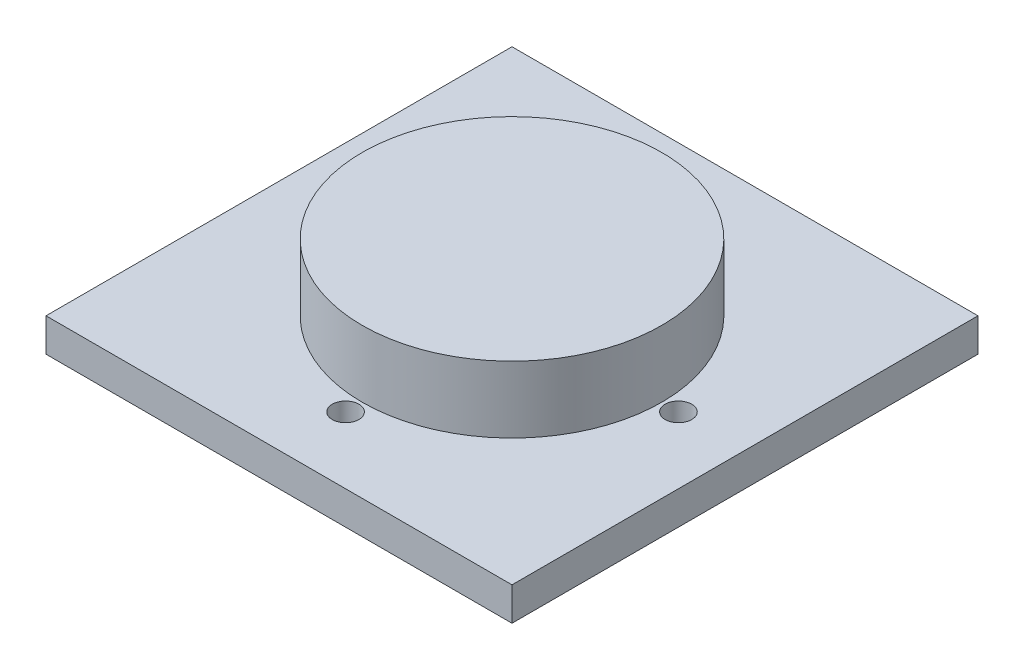
ISO-10303-21;
HEADER;
FILE_DESCRIPTION(('STEP AP214'),'2;1');
FILE_NAME('part.step','',(''),(''),'','','');
FILE_SCHEMA(('AUTOMOTIVE_DESIGN { 1 0 10303 214 1 1 1 1 }'));
ENDSEC;
DATA;
#1=APPLICATION_CONTEXT('core data for automotive mechanical design processes');
#2=APPLICATION_PROTOCOL_DEFINITION('international standard','automotive_design',2000,#1);
#3=PRODUCT_CONTEXT('',#1,'mechanical');
#4=PRODUCT('Part','Part','',(#3));
#5=PRODUCT_RELATED_PRODUCT_CATEGORY('part','',(#4));
#6=PRODUCT_DEFINITION_FORMATION('','',#4);
#7=PRODUCT_DEFINITION_CONTEXT('part definition',#1,'design');
#8=PRODUCT_DEFINITION('design','',#6,#7);
#9=PRODUCT_DEFINITION_SHAPE('','',#8);
#10=(LENGTH_UNIT() NAMED_UNIT(*) SI_UNIT(.MILLI.,.METRE.));
#11=(NAMED_UNIT(*) PLANE_ANGLE_UNIT() SI_UNIT($,.RADIAN.));
#12=(NAMED_UNIT(*) SI_UNIT($,.STERADIAN.) SOLID_ANGLE_UNIT());
#13=UNCERTAINTY_MEASURE_WITH_UNIT(LENGTH_MEASURE(1.E-05),#10,'distance_accuracy_value','');
#14=(GEOMETRIC_REPRESENTATION_CONTEXT(3) GLOBAL_UNCERTAINTY_ASSIGNED_CONTEXT((#13)) GLOBAL_UNIT_ASSIGNED_CONTEXT((#10,
#11,#12)) REPRESENTATION_CONTEXT('',''));
#15=CARTESIAN_POINT('',(0.,0.,0.));
#16=DIRECTION('',(0.,0.,1.));
#17=DIRECTION('',(1.,0.,0.));
#18=AXIS2_PLACEMENT_3D('',#15,#16,#17);
#19=CARTESIAN_POINT('',(0.,0.,0.));
#20=DIRECTION('',(0.,1.,0.));
#21=DIRECTION('',(1.,0.,0.));
#22=AXIS2_PLACEMENT_3D('',#19,#20,#21);
#23=PLANE('',#22);
#24=CARTESIAN_POINT('',(0.,0.,-25.));
#25=DIRECTION('',(0.,-1.,0.));
#26=DIRECTION('',(1.,0.,0.));
#27=AXIS2_PLACEMENT_3D('',#24,#25,#26);
#28=CIRCLE('',#27,2.);
#29=CARTESIAN_POINT('',(-2.,0.,-25.));
#30=VERTEX_POINT('',#29);
#31=EDGE_CURVE('E36',#30,#30,#28,.T.);
#32=ORIENTED_EDGE('',*,*,#31,.F.);
#33=EDGE_LOOP('',(#32));
#34=FACE_BOUND('',#33,.T.);
#35=CARTESIAN_POINT('',(25.,0.,0.));
#36=DIRECTION('',(0.,-1.,0.));
#37=DIRECTION('',(1.,0.,0.));
#38=AXIS2_PLACEMENT_3D('',#35,#36,#37);
#39=CIRCLE('',#38,2.);
#40=CARTESIAN_POINT('',(23.,0.,0.));
#41=VERTEX_POINT('',#40);
#42=EDGE_CURVE('E120',#41,#41,#39,.T.);
#43=ORIENTED_EDGE('',*,*,#42,.F.);
#44=EDGE_LOOP('',(#43));
#45=FACE_BOUND('',#44,.T.);
#46=CARTESIAN_POINT('',(0.,0.,25.));
#47=DIRECTION('',(0.,-1.,0.));
#48=DIRECTION('',(1.,0.,0.));
#49=AXIS2_PLACEMENT_3D('',#46,#47,#48);
#50=CIRCLE('',#49,2.);
#51=CARTESIAN_POINT('',(-2.,0.,25.));
#52=VERTEX_POINT('',#51);
#53=EDGE_CURVE('E134',#52,#52,#50,.T.);
#54=ORIENTED_EDGE('',*,*,#53,.F.);
#55=EDGE_LOOP('',(#54));
#56=FACE_BOUND('',#55,.T.);
#57=CARTESIAN_POINT('',(-25.,0.,0.));
#58=DIRECTION('',(0.,-1.,0.));
#59=DIRECTION('',(1.,0.,0.));
#60=AXIS2_PLACEMENT_3D('',#57,#58,#59);
#61=CIRCLE('',#60,2.);
#62=CARTESIAN_POINT('',(-27.,0.,0.));
#63=VERTEX_POINT('',#62);
#64=EDGE_CURVE('E147',#63,#63,#61,.T.);
#65=ORIENTED_EDGE('',*,*,#64,.F.);
#66=EDGE_LOOP('',(#65));
#67=FACE_BOUND('',#66,.T.);
#68=DIRECTION('',(0.,0.,-1.));
#69=VECTOR('',#68,1.);
#70=CARTESIAN_POINT('',(35.,0.,35.));
#71=LINE('',#70,#69);
#72=CARTESIAN_POINT('',(35.,0.,35.));
#73=VERTEX_POINT('',#72);
#74=CARTESIAN_POINT('',(35.,0.,-35.));
#75=VERTEX_POINT('',#74);
#76=EDGE_CURVE('E42',#73,#75,#71,.T.);
#77=ORIENTED_EDGE('',*,*,#76,.F.);
#78=DIRECTION('',(1.,0.,0.));
#79=VECTOR('',#78,1.);
#80=CARTESIAN_POINT('',(-35.,0.,35.));
#81=LINE('',#80,#79);
#82=CARTESIAN_POINT('',(-35.,0.,35.));
#83=VERTEX_POINT('',#82);
#84=EDGE_CURVE('E117',#83,#73,#81,.T.);
#85=ORIENTED_EDGE('',*,*,#84,.F.);
#86=DIRECTION('',(0.,0.,1.));
#87=VECTOR('',#86,1.);
#88=CARTESIAN_POINT('',(-35.,0.,-35.));
#89=LINE('',#88,#87);
#90=CARTESIAN_POINT('',(-35.,0.,-35.));
#91=VERTEX_POINT('',#90);
#92=EDGE_CURVE('E77',#91,#83,#89,.T.);
#93=ORIENTED_EDGE('',*,*,#92,.F.);
#94=DIRECTION('',(-1.,0.,0.));
#95=VECTOR('',#94,1.);
#96=CARTESIAN_POINT('',(35.,0.,-35.));
#97=LINE('',#96,#95);
#98=EDGE_CURVE('E138',#75,#91,#97,.T.);
#99=ORIENTED_EDGE('',*,*,#98,.F.);
#100=EDGE_LOOP('',(#77,#85,#93,#99));
#101=FACE_BOUND('',#100,.T.);
#102=ADVANCED_FACE('F32',(#34,#45,#56,#67,#101),#23,.F.);
#103=CARTESIAN_POINT('',(0.,5.,0.));
#104=DIRECTION('',(0.,1.,0.));
#105=DIRECTION('',(1.,0.,0.));
#106=AXIS2_PLACEMENT_3D('',#103,#104,#105);
#107=PLANE('',#106);
#108=CARTESIAN_POINT('',(0.,5.,0.));
#109=DIRECTION('',(0.,1.,0.));
#110=DIRECTION('',(0.,0.,1.));
#111=AXIS2_PLACEMENT_3D('',#108,#109,#110);
#112=CIRCLE('',#111,22.5);
#113=CARTESIAN_POINT('',(0.,5.,22.5));
#114=VERTEX_POINT('',#113);
#115=EDGE_CURVE('E161',#114,#114,#112,.T.);
#116=ORIENTED_EDGE('',*,*,#115,.F.);
#117=EDGE_LOOP('',(#116));
#118=FACE_BOUND('',#117,.T.);
#119=CARTESIAN_POINT('',(0.,5.,-25.));
#120=DIRECTION('',(0.,-1.,0.));
#121=DIRECTION('',(1.,0.,0.));
#122=AXIS2_PLACEMENT_3D('',#119,#120,#121);
#123=CIRCLE('',#122,2.);
#124=CARTESIAN_POINT('',(-2.,5.,-25.));
#125=VERTEX_POINT('',#124);
#126=EDGE_CURVE('E133',#125,#125,#123,.T.);
#127=ORIENTED_EDGE('',*,*,#126,.T.);
#128=EDGE_LOOP('',(#127));
#129=FACE_BOUND('',#128,.T.);
#130=CARTESIAN_POINT('',(25.,5.,0.));
#131=DIRECTION('',(0.,-1.,0.));
#132=DIRECTION('',(1.,0.,0.));
#133=AXIS2_PLACEMENT_3D('',#130,#131,#132);
#134=CIRCLE('',#133,2.);
#135=CARTESIAN_POINT('',(23.,5.,0.));
#136=VERTEX_POINT('',#135);
#137=EDGE_CURVE('E128',#136,#136,#134,.T.);
#138=ORIENTED_EDGE('',*,*,#137,.T.);
#139=EDGE_LOOP('',(#138));
#140=FACE_BOUND('',#139,.T.);
#141=CARTESIAN_POINT('',(0.,5.,25.));
#142=DIRECTION('',(0.,-1.,0.));
#143=DIRECTION('',(1.,0.,0.));
#144=AXIS2_PLACEMENT_3D('',#141,#142,#143);
#145=CIRCLE('',#144,2.);
#146=CARTESIAN_POINT('',(-2.,5.,25.));
#147=VERTEX_POINT('',#146);
#148=EDGE_CURVE('E142',#147,#147,#145,.T.);
#149=ORIENTED_EDGE('',*,*,#148,.T.);
#150=EDGE_LOOP('',(#149));
#151=FACE_BOUND('',#150,.T.);
#152=CARTESIAN_POINT('',(-25.,5.,0.));
#153=DIRECTION('',(0.,-1.,0.));
#154=DIRECTION('',(1.,0.,0.));
#155=AXIS2_PLACEMENT_3D('',#152,#153,#154);
#156=CIRCLE('',#155,2.);
#157=CARTESIAN_POINT('',(-27.,5.,0.));
#158=VERTEX_POINT('',#157);
#159=EDGE_CURVE('E136',#158,#158,#156,.T.);
#160=ORIENTED_EDGE('',*,*,#159,.T.);
#161=EDGE_LOOP('',(#160));
#162=FACE_BOUND('',#161,.T.);
#163=DIRECTION('',(0.,0.,-1.));
#164=VECTOR('',#163,1.);
#165=CARTESIAN_POINT('',(35.,5.,35.));
#166=LINE('',#165,#164);
#167=CARTESIAN_POINT('',(35.,5.,35.));
#168=VERTEX_POINT('',#167);
#169=CARTESIAN_POINT('',(35.,5.,-35.));
#170=VERTEX_POINT('',#169);
#171=EDGE_CURVE('E11',#168,#170,#166,.T.);
#172=ORIENTED_EDGE('',*,*,#171,.T.);
#173=DIRECTION('',(-1.,0.,0.));
#174=VECTOR('',#173,1.);
#175=CARTESIAN_POINT('',(35.,5.,-35.));
#176=LINE('',#175,#174);
#177=CARTESIAN_POINT('',(-35.,5.,-35.));
#178=VERTEX_POINT('',#177);
#179=EDGE_CURVE('E105',#170,#178,#176,.T.);
#180=ORIENTED_EDGE('',*,*,#179,.T.);
#181=DIRECTION('',(0.,0.,1.));
#182=VECTOR('',#181,1.);
#183=CARTESIAN_POINT('',(-35.,5.,-35.));
#184=LINE('',#183,#182);
#185=CARTESIAN_POINT('',(-35.,5.,35.));
#186=VERTEX_POINT('',#185);
#187=EDGE_CURVE('E100',#178,#186,#184,.T.);
#188=ORIENTED_EDGE('',*,*,#187,.T.);
#189=DIRECTION('',(1.,0.,0.));
#190=VECTOR('',#189,1.);
#191=CARTESIAN_POINT('',(-35.,5.,35.));
#192=LINE('',#191,#190);
#193=EDGE_CURVE('E102',#186,#168,#192,.T.);
#194=ORIENTED_EDGE('',*,*,#193,.T.);
#195=EDGE_LOOP('',(#172,#180,#188,#194));
#196=FACE_BOUND('',#195,.T.);
#197=ADVANCED_FACE('F34',(#118,#129,#140,#151,#162,#196),#107,.T.);
#198=CARTESIAN_POINT('',(35.,0.,35.));
#199=DIRECTION('',(1.,0.,0.));
#200=DIRECTION('',(0.,1.,0.));
#201=AXIS2_PLACEMENT_3D('',#198,#199,#200);
#202=PLANE('',#201);
#203=ORIENTED_EDGE('',*,*,#76,.T.);
#204=DIRECTION('',(0.,1.,0.));
#205=VECTOR('',#204,1.);
#206=CARTESIAN_POINT('',(35.,0.,-35.));
#207=LINE('',#206,#205);
#208=EDGE_CURVE('E124',#75,#170,#207,.T.);
#209=ORIENTED_EDGE('',*,*,#208,.T.);
#210=ORIENTED_EDGE('',*,*,#171,.F.);
#211=DIRECTION('',(0.,1.,0.));
#212=VECTOR('',#211,1.);
#213=CARTESIAN_POINT('',(35.,0.,35.));
#214=LINE('',#213,#212);
#215=EDGE_CURVE('E115',#73,#168,#214,.T.);
#216=ORIENTED_EDGE('',*,*,#215,.F.);
#217=EDGE_LOOP('',(#203,#209,#210,#216));
#218=FACE_BOUND('',#217,.T.);
#219=ADVANCED_FACE('F178',(#218),#202,.T.);
#220=CARTESIAN_POINT('',(35.,0.,-35.));
#221=DIRECTION('',(0.,0.,-1.));
#222=DIRECTION('',(0.,-1.,0.));
#223=AXIS2_PLACEMENT_3D('',#220,#221,#222);
#224=PLANE('',#223);
#225=ORIENTED_EDGE('',*,*,#98,.T.);
#226=DIRECTION('',(0.,1.,0.));
#227=VECTOR('',#226,1.);
#228=CARTESIAN_POINT('',(-35.,0.,-35.));
#229=LINE('',#228,#227);
#230=EDGE_CURVE('E107',#91,#178,#229,.T.);
#231=ORIENTED_EDGE('',*,*,#230,.T.);
#232=ORIENTED_EDGE('',*,*,#179,.F.);
#233=ORIENTED_EDGE('',*,*,#208,.F.);
#234=EDGE_LOOP('',(#225,#231,#232,#233));
#235=FACE_BOUND('',#234,.T.);
#236=ADVANCED_FACE('F207',(#235),#224,.T.);
#237=CARTESIAN_POINT('',(-35.,0.,-35.));
#238=DIRECTION('',(-1.,0.,0.));
#239=DIRECTION('',(0.,0.,1.));
#240=AXIS2_PLACEMENT_3D('',#237,#238,#239);
#241=PLANE('',#240);
#242=ORIENTED_EDGE('',*,*,#92,.T.);
#243=DIRECTION('',(0.,1.,0.));
#244=VECTOR('',#243,1.);
#245=CARTESIAN_POINT('',(-35.,0.,35.));
#246=LINE('',#245,#244);
#247=EDGE_CURVE('E109',#83,#186,#246,.T.);
#248=ORIENTED_EDGE('',*,*,#247,.T.);
#249=ORIENTED_EDGE('',*,*,#187,.F.);
#250=ORIENTED_EDGE('',*,*,#230,.F.);
#251=EDGE_LOOP('',(#242,#248,#249,#250));
#252=FACE_BOUND('',#251,.T.);
#253=ADVANCED_FACE('F110',(#252),#241,.T.);
#254=CARTESIAN_POINT('',(-35.,0.,35.));
#255=DIRECTION('',(0.,0.,1.));
#256=DIRECTION('',(1.,0.,0.));
#257=AXIS2_PLACEMENT_3D('',#254,#255,#256);
#258=PLANE('',#257);
#259=ORIENTED_EDGE('',*,*,#84,.T.);
#260=ORIENTED_EDGE('',*,*,#215,.T.);
#261=ORIENTED_EDGE('',*,*,#193,.F.);
#262=ORIENTED_EDGE('',*,*,#247,.F.);
#263=EDGE_LOOP('',(#259,#260,#261,#262));
#264=FACE_BOUND('',#263,.T.);
#265=ADVANCED_FACE('F114',(#264),#258,.T.);
#266=CARTESIAN_POINT('',(-25.,0.,0.));
#267=DIRECTION('',(0.,1.,0.));
#268=DIRECTION('',(1.,0.,0.));
#269=AXIS2_PLACEMENT_3D('',#266,#267,#268);
#270=CYLINDRICAL_SURFACE('',#269,2.);
#271=ORIENTED_EDGE('',*,*,#159,.F.);
#272=DIRECTION('',(0.,-1.,0.));
#273=VECTOR('',#272,1.);
#274=CARTESIAN_POINT('',(-27.,0.,0.));
#275=LINE('',#274,#273);
#276=EDGE_CURVE('E145',#158,#63,#275,.T.);
#277=ORIENTED_EDGE('',*,*,#276,.T.);
#278=ORIENTED_EDGE('',*,*,#64,.T.);
#279=ORIENTED_EDGE('',*,*,#276,.F.);
#280=EDGE_LOOP('',(#271,#277,#278,#279));
#281=FACE_BOUND('',#280,.T.);
#282=ADVANCED_FACE('F186',(#281),#270,.F.);
#283=CARTESIAN_POINT('',(0.,0.,25.));
#284=DIRECTION('',(0.,1.,0.));
#285=DIRECTION('',(1.,0.,0.));
#286=AXIS2_PLACEMENT_3D('',#283,#284,#285);
#287=CYLINDRICAL_SURFACE('',#286,2.);
#288=ORIENTED_EDGE('',*,*,#148,.F.);
#289=DIRECTION('',(0.,-1.,0.));
#290=VECTOR('',#289,1.);
#291=CARTESIAN_POINT('',(-2.,0.,25.));
#292=LINE('',#291,#290);
#293=EDGE_CURVE('E137',#147,#52,#292,.T.);
#294=ORIENTED_EDGE('',*,*,#293,.T.);
#295=ORIENTED_EDGE('',*,*,#53,.T.);
#296=ORIENTED_EDGE('',*,*,#293,.F.);
#297=EDGE_LOOP('',(#288,#294,#295,#296));
#298=FACE_BOUND('',#297,.T.);
#299=ADVANCED_FACE('F188',(#298),#287,.F.);
#300=CARTESIAN_POINT('',(25.,0.,0.));
#301=DIRECTION('',(0.,1.,0.));
#302=DIRECTION('',(1.,0.,0.));
#303=AXIS2_PLACEMENT_3D('',#300,#301,#302);
#304=CYLINDRICAL_SURFACE('',#303,2.);
#305=ORIENTED_EDGE('',*,*,#137,.F.);
#306=DIRECTION('',(0.,-1.,0.));
#307=VECTOR('',#306,1.);
#308=CARTESIAN_POINT('',(23.,0.,0.));
#309=LINE('',#308,#307);
#310=EDGE_CURVE('E125',#136,#41,#309,.T.);
#311=ORIENTED_EDGE('',*,*,#310,.T.);
#312=ORIENTED_EDGE('',*,*,#42,.T.);
#313=ORIENTED_EDGE('',*,*,#310,.F.);
#314=EDGE_LOOP('',(#305,#311,#312,#313));
#315=FACE_BOUND('',#314,.T.);
#316=ADVANCED_FACE('F194',(#315),#304,.F.);
#317=CARTESIAN_POINT('',(0.,0.,-25.));
#318=DIRECTION('',(0.,1.,0.));
#319=DIRECTION('',(1.,0.,0.));
#320=AXIS2_PLACEMENT_3D('',#317,#318,#319);
#321=CYLINDRICAL_SURFACE('',#320,2.);
#322=ORIENTED_EDGE('',*,*,#126,.F.);
#323=DIRECTION('',(0.,-1.,0.));
#324=VECTOR('',#323,1.);
#325=CARTESIAN_POINT('',(-2.,0.,-25.));
#326=LINE('',#325,#324);
#327=EDGE_CURVE('E130',#125,#30,#326,.T.);
#328=ORIENTED_EDGE('',*,*,#327,.T.);
#329=ORIENTED_EDGE('',*,*,#31,.T.);
#330=ORIENTED_EDGE('',*,*,#327,.F.);
#331=EDGE_LOOP('',(#322,#328,#329,#330));
#332=FACE_BOUND('',#331,.T.);
#333=ADVANCED_FACE('F172',(#332),#321,.F.);
#334=CARTESIAN_POINT('',(0.,15.,0.));
#335=DIRECTION('',(0.,-1.,0.));
#336=DIRECTION('',(0.,0.,-1.));
#337=AXIS2_PLACEMENT_3D('',#334,#335,#336);
#338=CYLINDRICAL_SURFACE('',#337,22.5);
#339=CARTESIAN_POINT('',(0.,15.,0.));
#340=DIRECTION('',(0.,1.,0.));
#341=DIRECTION('',(0.,0.,1.));
#342=AXIS2_PLACEMENT_3D('',#339,#340,#341);
#343=CIRCLE('',#342,22.5);
#344=CARTESIAN_POINT('',(0.,15.,22.5));
#345=VERTEX_POINT('',#344);
#346=EDGE_CURVE('E151',#345,#345,#343,.T.);
#347=ORIENTED_EDGE('',*,*,#346,.F.);
#348=EDGE_LOOP('',(#347));
#349=FACE_BOUND('',#348,.T.);
#350=ORIENTED_EDGE('',*,*,#115,.T.);
#351=EDGE_LOOP('',(#350));
#352=FACE_BOUND('',#351,.T.);
#353=ADVANCED_FACE('F169',(#349,#352),#338,.T.);
#354=CARTESIAN_POINT('',(0.,15.,0.));
#355=DIRECTION('',(0.,1.,0.));
#356=DIRECTION('',(0.,0.,1.));
#357=AXIS2_PLACEMENT_3D('',#354,#355,#356);
#358=PLANE('',#357);
#359=ORIENTED_EDGE('',*,*,#346,.T.);
#360=EDGE_LOOP('',(#359));
#361=FACE_BOUND('',#360,.T.);
#362=ADVANCED_FACE('F167',(#361),#358,.T.);
#363=CLOSED_SHELL('',(#102,#197,#219,#236,#253,#265,#282,#299,#316,#333,#353,#362));
#364=MANIFOLD_SOLID_BREP('B2',#363);
#365=ADVANCED_BREP_SHAPE_REPRESENTATION('',(#18,#364),#14);
#366=SHAPE_DEFINITION_REPRESENTATION(#9,#365);
ENDSEC;
END-ISO-10303-21;
